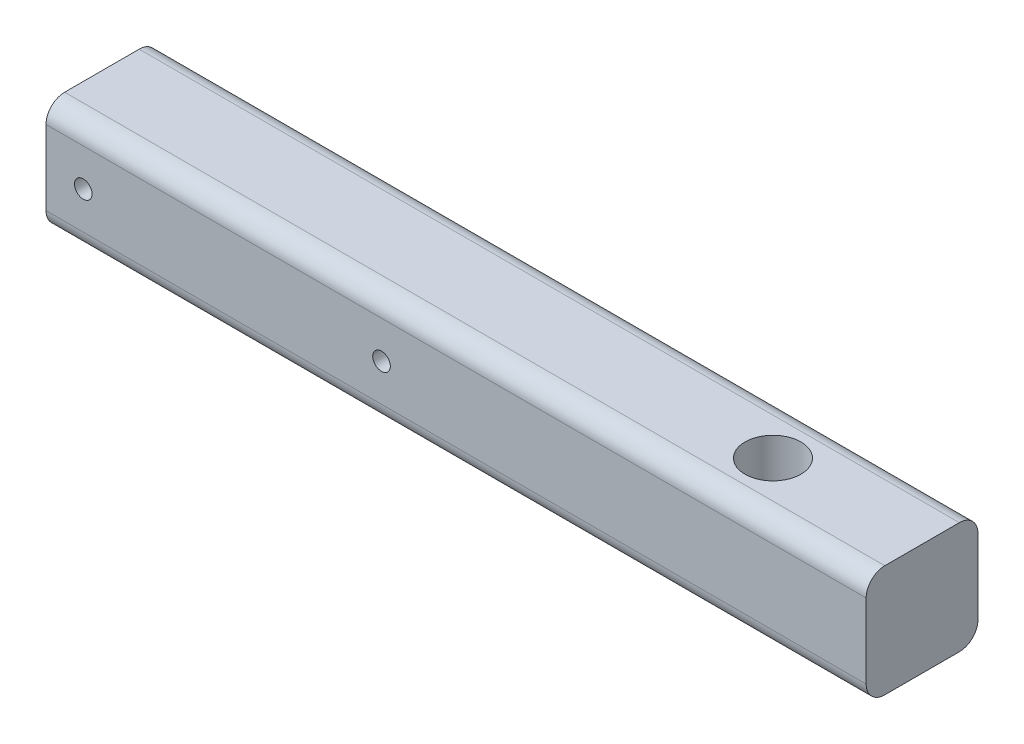
ISO-10303-21;
HEADER;
FILE_DESCRIPTION(('STEP AP214'),'2;1');
FILE_NAME('part.step','',(''),(''),'','','');
FILE_SCHEMA(('AUTOMOTIVE_DESIGN { 1 0 10303 214 1 1 1 1 }'));
ENDSEC;
DATA;
#1=APPLICATION_CONTEXT('core data for automotive mechanical design processes');
#2=APPLICATION_PROTOCOL_DEFINITION('international standard','automotive_design',2000,#1);
#3=PRODUCT_CONTEXT('',#1,'mechanical');
#4=PRODUCT('Part','Part','',(#3));
#5=PRODUCT_RELATED_PRODUCT_CATEGORY('part','',(#4));
#6=PRODUCT_DEFINITION_FORMATION('','',#4);
#7=PRODUCT_DEFINITION_CONTEXT('part definition',#1,'design');
#8=PRODUCT_DEFINITION('design','',#6,#7);
#9=PRODUCT_DEFINITION_SHAPE('','',#8);
#10=(LENGTH_UNIT() NAMED_UNIT(*) SI_UNIT(.MILLI.,.METRE.));
#11=(NAMED_UNIT(*) PLANE_ANGLE_UNIT() SI_UNIT($,.RADIAN.));
#12=(NAMED_UNIT(*) SI_UNIT($,.STERADIAN.) SOLID_ANGLE_UNIT());
#13=UNCERTAINTY_MEASURE_WITH_UNIT(LENGTH_MEASURE(1.E-05),#10,'distance_accuracy_value','');
#14=(GEOMETRIC_REPRESENTATION_CONTEXT(3) GLOBAL_UNCERTAINTY_ASSIGNED_CONTEXT((#13)) GLOBAL_UNIT_ASSIGNED_CONTEXT((#10,
#11,#12)) REPRESENTATION_CONTEXT('',''));
#15=CARTESIAN_POINT('',(0.,0.,0.));
#16=DIRECTION('',(0.,0.,1.));
#17=DIRECTION('',(1.,0.,0.));
#18=AXIS2_PLACEMENT_3D('',#15,#16,#17);
#19=CARTESIAN_POINT('',(139.7,-9.525,9.525));
#20=DIRECTION('',(0.,1.,0.));
#21=DIRECTION('',(0.,0.,1.));
#22=AXIS2_PLACEMENT_3D('',#19,#20,#21);
#23=PLANE('',#22);
#24=CARTESIAN_POINT('',(114.3,-9.525,0.));
#25=DIRECTION('',(0.,1.,0.));
#26=DIRECTION('',(0.,0.,1.));
#27=AXIS2_PLACEMENT_3D('',#24,#25,#26);
#28=CIRCLE('',#27,4.7625);
#29=CARTESIAN_POINT('',(114.3,-9.525,4.7625));
#30=VERTEX_POINT('',#29);
#31=EDGE_CURVE('E132',#30,#30,#28,.T.);
#32=ORIENTED_EDGE('',*,*,#31,.T.);
#33=EDGE_LOOP('',(#32));
#34=FACE_BOUND('',#33,.T.);
#35=DIRECTION('',(0.,0.,-1.));
#36=VECTOR('',#35,1.);
#37=CARTESIAN_POINT('',(0.,-9.525,9.525));
#38=LINE('',#37,#36);
#39=CARTESIAN_POINT('',(0.,-9.525,6.35));
#40=VERTEX_POINT('',#39);
#41=CARTESIAN_POINT('',(0.,-9.525,-6.34999999999999));
#42=VERTEX_POINT('',#41);
#43=EDGE_CURVE('E128',#40,#42,#38,.T.);
#44=ORIENTED_EDGE('',*,*,#43,.T.);
#45=DIRECTION('',(-1.,0.,0.));
#46=VECTOR('',#45,1.);
#47=CARTESIAN_POINT('',(139.7,-9.525,-6.35));
#48=LINE('',#47,#46);
#49=CARTESIAN_POINT('',(139.7,-9.525,-6.34999999999999));
#50=VERTEX_POINT('',#49);
#51=EDGE_CURVE('E105',#42,#50,#48,.F.);
#52=ORIENTED_EDGE('',*,*,#51,.T.);
#53=DIRECTION('',(0.,0.,-1.));
#54=VECTOR('',#53,1.);
#55=CARTESIAN_POINT('',(139.7,-9.525,9.525));
#56=LINE('',#55,#54);
#57=CARTESIAN_POINT('',(139.7,-9.525,6.35));
#58=VERTEX_POINT('',#57);
#59=EDGE_CURVE('E138',#58,#50,#56,.T.);
#60=ORIENTED_EDGE('',*,*,#59,.F.);
#61=DIRECTION('',(-1.,0.,0.));
#62=VECTOR('',#61,1.);
#63=CARTESIAN_POINT('',(0.,-9.525,6.35));
#64=LINE('',#63,#62);
#65=EDGE_CURVE('E110',#58,#40,#64,.T.);
#66=ORIENTED_EDGE('',*,*,#65,.T.);
#67=EDGE_LOOP('',(#44,#52,#60,#66));
#68=FACE_BOUND('',#67,.T.);
#69=ADVANCED_FACE('F33',(#34,#68),#23,.F.);
#70=CARTESIAN_POINT('',(139.7,-9.525,-9.525));
#71=DIRECTION('',(0.,0.,1.));
#72=DIRECTION('',(1.,0.,0.));
#73=AXIS2_PLACEMENT_3D('',#70,#71,#72);
#74=PLANE('',#73);
#75=CARTESIAN_POINT('',(57.15,0.,-9.525));
#76=DIRECTION('',(0.,0.,1.));
#77=DIRECTION('',(1.,0.,0.));
#78=AXIS2_PLACEMENT_3D('',#75,#76,#77);
#79=CIRCLE('',#78,1.5);
#80=CARTESIAN_POINT('',(58.65,0.,-9.525));
#81=VERTEX_POINT('',#80);
#82=EDGE_CURVE('E189',#81,#81,#79,.T.);
#83=ORIENTED_EDGE('',*,*,#82,.T.);
#84=EDGE_LOOP('',(#83));
#85=FACE_BOUND('',#84,.T.);
#86=CARTESIAN_POINT('',(6.35,0.,-9.525));
#87=DIRECTION('',(0.,0.,1.));
#88=DIRECTION('',(1.,0.,0.));
#89=AXIS2_PLACEMENT_3D('',#86,#87,#88);
#90=CIRCLE('',#89,1.5);
#91=CARTESIAN_POINT('',(7.85,0.,-9.525));
#92=VERTEX_POINT('',#91);
#93=EDGE_CURVE('E183',#92,#92,#90,.T.);
#94=ORIENTED_EDGE('',*,*,#93,.T.);
#95=EDGE_LOOP('',(#94));
#96=FACE_BOUND('',#95,.T.);
#97=DIRECTION('',(0.,1.,0.));
#98=VECTOR('',#97,1.);
#99=CARTESIAN_POINT('',(139.7,-9.525,-9.525));
#100=LINE('',#99,#98);
#101=CARTESIAN_POINT('',(139.7,-6.35,-9.525));
#102=VERTEX_POINT('',#101);
#103=CARTESIAN_POINT('',(139.7,6.34999999999999,-9.525));
#104=VERTEX_POINT('',#103);
#105=EDGE_CURVE('E120',#102,#104,#100,.T.);
#106=ORIENTED_EDGE('',*,*,#105,.F.);
#107=DIRECTION('',(-1.,0.,0.));
#108=VECTOR('',#107,1.);
#109=CARTESIAN_POINT('',(139.7,-6.35,-9.525));
#110=LINE('',#109,#108);
#111=CARTESIAN_POINT('',(0.,-6.35,-9.525));
#112=VERTEX_POINT('',#111);
#113=EDGE_CURVE('E104',#102,#112,#110,.T.);
#114=ORIENTED_EDGE('',*,*,#113,.T.);
#115=DIRECTION('',(0.,1.,0.));
#116=VECTOR('',#115,1.);
#117=CARTESIAN_POINT('',(0.,-9.525,-9.525));
#118=LINE('',#117,#116);
#119=CARTESIAN_POINT('',(0.,6.34999999999999,-9.525));
#120=VERTEX_POINT('',#119);
#121=EDGE_CURVE('E117',#112,#120,#118,.T.);
#122=ORIENTED_EDGE('',*,*,#121,.T.);
#123=DIRECTION('',(-1.,0.,0.));
#124=VECTOR('',#123,1.);
#125=CARTESIAN_POINT('',(139.7,6.35,-9.525));
#126=LINE('',#125,#124);
#127=EDGE_CURVE('E122',#120,#104,#126,.F.);
#128=ORIENTED_EDGE('',*,*,#127,.T.);
#129=EDGE_LOOP('',(#106,#114,#122,#128));
#130=FACE_BOUND('',#129,.T.);
#131=ADVANCED_FACE('F116',(#85,#96,#130),#74,.F.);
#132=CARTESIAN_POINT('',(139.7,9.525,9.525));
#133=DIRECTION('',(0.,1.,0.));
#134=DIRECTION('',(0.,0.,1.));
#135=AXIS2_PLACEMENT_3D('',#132,#133,#134);
#136=PLANE('',#135);
#137=CARTESIAN_POINT('',(114.3,9.525,0.));
#138=DIRECTION('',(0.,1.,0.));
#139=DIRECTION('',(0.,0.,1.));
#140=AXIS2_PLACEMENT_3D('',#137,#138,#139);
#141=CIRCLE('',#140,4.7625);
#142=CARTESIAN_POINT('',(114.3,9.525,4.7625));
#143=VERTEX_POINT('',#142);
#144=EDGE_CURVE('E180',#143,#143,#141,.T.);
#145=ORIENTED_EDGE('',*,*,#144,.F.);
#146=EDGE_LOOP('',(#145));
#147=FACE_BOUND('',#146,.T.);
#148=DIRECTION('',(0.,0.,-1.));
#149=VECTOR('',#148,1.);
#150=CARTESIAN_POINT('',(139.7,9.525,9.525));
#151=LINE('',#150,#149);
#152=CARTESIAN_POINT('',(139.7,9.525,6.35));
#153=VERTEX_POINT('',#152);
#154=CARTESIAN_POINT('',(139.7,9.525,-6.34999999999999));
#155=VERTEX_POINT('',#154);
#156=EDGE_CURVE('E162',#153,#155,#151,.T.);
#157=ORIENTED_EDGE('',*,*,#156,.T.);
#158=DIRECTION('',(-1.,0.,0.));
#159=VECTOR('',#158,1.);
#160=CARTESIAN_POINT('',(0.,9.525,-6.35));
#161=LINE('',#160,#159);
#162=CARTESIAN_POINT('',(0.,9.525,-6.34999999999999));
#163=VERTEX_POINT('',#162);
#164=EDGE_CURVE('E11',#155,#163,#161,.T.);
#165=ORIENTED_EDGE('',*,*,#164,.T.);
#166=DIRECTION('',(0.,0.,-1.));
#167=VECTOR('',#166,1.);
#168=CARTESIAN_POINT('',(0.,9.525,9.525));
#169=LINE('',#168,#167);
#170=CARTESIAN_POINT('',(0.,9.525,6.35));
#171=VERTEX_POINT('',#170);
#172=EDGE_CURVE('E127',#171,#163,#169,.T.);
#173=ORIENTED_EDGE('',*,*,#172,.F.);
#174=DIRECTION('',(-1.,0.,0.));
#175=VECTOR('',#174,1.);
#176=CARTESIAN_POINT('',(139.7,9.525,6.35));
#177=LINE('',#176,#175);
#178=EDGE_CURVE('E41',#171,#153,#177,.F.);
#179=ORIENTED_EDGE('',*,*,#178,.T.);
#180=EDGE_LOOP('',(#157,#165,#173,#179));
#181=FACE_BOUND('',#180,.T.);
#182=ADVANCED_FACE('F161',(#147,#181),#136,.T.);
#183=CARTESIAN_POINT('',(139.7,-9.525,9.525));
#184=DIRECTION('',(0.,0.,1.));
#185=DIRECTION('',(1.,0.,0.));
#186=AXIS2_PLACEMENT_3D('',#183,#184,#185);
#187=PLANE('',#186);
#188=CARTESIAN_POINT('',(57.15,0.,9.525));
#189=DIRECTION('',(0.,0.,1.));
#190=DIRECTION('',(1.,0.,0.));
#191=AXIS2_PLACEMENT_3D('',#188,#189,#190);
#192=CIRCLE('',#191,1.5);
#193=CARTESIAN_POINT('',(58.65,0.,9.525));
#194=VERTEX_POINT('',#193);
#195=EDGE_CURVE('E192',#194,#194,#192,.T.);
#196=ORIENTED_EDGE('',*,*,#195,.F.);
#197=EDGE_LOOP('',(#196));
#198=FACE_BOUND('',#197,.T.);
#199=CARTESIAN_POINT('',(6.35,0.,9.525));
#200=DIRECTION('',(0.,0.,1.));
#201=DIRECTION('',(1.,0.,0.));
#202=AXIS2_PLACEMENT_3D('',#199,#200,#201);
#203=CIRCLE('',#202,1.5);
#204=CARTESIAN_POINT('',(7.85,0.,9.525));
#205=VERTEX_POINT('',#204);
#206=EDGE_CURVE('E186',#205,#205,#203,.T.);
#207=ORIENTED_EDGE('',*,*,#206,.F.);
#208=EDGE_LOOP('',(#207));
#209=FACE_BOUND('',#208,.T.);
#210=DIRECTION('',(0.,1.,0.));
#211=VECTOR('',#210,1.);
#212=CARTESIAN_POINT('',(0.,-9.525,9.525));
#213=LINE('',#212,#211);
#214=CARTESIAN_POINT('',(0.,-6.35,9.525));
#215=VERTEX_POINT('',#214);
#216=CARTESIAN_POINT('',(0.,6.34999999999999,9.525));
#217=VERTEX_POINT('',#216);
#218=EDGE_CURVE('E130',#215,#217,#213,.T.);
#219=ORIENTED_EDGE('',*,*,#218,.F.);
#220=DIRECTION('',(-1.,0.,0.));
#221=VECTOR('',#220,1.);
#222=CARTESIAN_POINT('',(139.7,-6.35,9.525));
#223=LINE('',#222,#221);
#224=CARTESIAN_POINT('',(139.7,-6.35,9.525));
#225=VERTEX_POINT('',#224);
#226=EDGE_CURVE('E55',#215,#225,#223,.F.);
#227=ORIENTED_EDGE('',*,*,#226,.T.);
#228=DIRECTION('',(0.,1.,0.));
#229=VECTOR('',#228,1.);
#230=CARTESIAN_POINT('',(139.7,-9.525,9.525));
#231=LINE('',#230,#229);
#232=CARTESIAN_POINT('',(139.7,6.34999999999999,9.525));
#233=VERTEX_POINT('',#232);
#234=EDGE_CURVE('E139',#225,#233,#231,.T.);
#235=ORIENTED_EDGE('',*,*,#234,.T.);
#236=DIRECTION('',(-1.,0.,0.));
#237=VECTOR('',#236,1.);
#238=CARTESIAN_POINT('',(139.7,6.35,9.525));
#239=LINE('',#238,#237);
#240=EDGE_CURVE('E154',#233,#217,#239,.T.);
#241=ORIENTED_EDGE('',*,*,#240,.T.);
#242=EDGE_LOOP('',(#219,#227,#235,#241));
#243=FACE_BOUND('',#242,.T.);
#244=ADVANCED_FACE('F170',(#198,#209,#243),#187,.T.);
#245=CARTESIAN_POINT('',(139.7,0.,0.));
#246=DIRECTION('',(1.,0.,0.));
#247=DIRECTION('',(0.,0.,-1.));
#248=AXIS2_PLACEMENT_3D('',#245,#246,#247);
#249=PLANE('',#248);
#250=ORIENTED_EDGE('',*,*,#59,.T.);
#251=CARTESIAN_POINT('',(139.7,-6.35,-6.35));
#252=DIRECTION('',(1.,0.,0.));
#253=DIRECTION('',(0.,0.,-1.));
#254=AXIS2_PLACEMENT_3D('',#251,#252,#253);
#255=CIRCLE('',#254,3.175);
#256=EDGE_CURVE('E152',#50,#102,#255,.T.);
#257=ORIENTED_EDGE('',*,*,#256,.T.);
#258=ORIENTED_EDGE('',*,*,#105,.T.);
#259=CARTESIAN_POINT('',(139.7,6.35,-6.35));
#260=DIRECTION('',(1.,0.,0.));
#261=DIRECTION('',(0.,0.,-1.));
#262=AXIS2_PLACEMENT_3D('',#259,#260,#261);
#263=CIRCLE('',#262,3.175);
#264=EDGE_CURVE('E148',#104,#155,#263,.T.);
#265=ORIENTED_EDGE('',*,*,#264,.T.);
#266=ORIENTED_EDGE('',*,*,#156,.F.);
#267=CARTESIAN_POINT('',(139.7,6.35,6.35));
#268=DIRECTION('',(1.,0.,0.));
#269=DIRECTION('',(0.,0.,-1.));
#270=AXIS2_PLACEMENT_3D('',#267,#268,#269);
#271=CIRCLE('',#270,3.175);
#272=EDGE_CURVE('E48',#153,#233,#271,.T.);
#273=ORIENTED_EDGE('',*,*,#272,.T.);
#274=ORIENTED_EDGE('',*,*,#234,.F.);
#275=CARTESIAN_POINT('',(139.7,-6.35,6.35));
#276=DIRECTION('',(1.,0.,0.));
#277=DIRECTION('',(0.,0.,-1.));
#278=AXIS2_PLACEMENT_3D('',#275,#276,#277);
#279=CIRCLE('',#278,3.175);
#280=EDGE_CURVE('E150',#225,#58,#279,.T.);
#281=ORIENTED_EDGE('',*,*,#280,.T.);
#282=EDGE_LOOP('',(#250,#257,#258,#265,#266,#273,#274,#281));
#283=FACE_BOUND('',#282,.T.);
#284=ADVANCED_FACE('F166',(#283),#249,.T.);
#285=CARTESIAN_POINT('',(0.,0.,0.));
#286=DIRECTION('',(1.,0.,0.));
#287=DIRECTION('',(0.,0.,-1.));
#288=AXIS2_PLACEMENT_3D('',#285,#286,#287);
#289=PLANE('',#288);
#290=ORIENTED_EDGE('',*,*,#121,.F.);
#291=CARTESIAN_POINT('',(0.,-6.35,-6.35));
#292=DIRECTION('',(1.,0.,0.));
#293=DIRECTION('',(0.,0.,-1.));
#294=AXIS2_PLACEMENT_3D('',#291,#292,#293);
#295=CIRCLE('',#294,3.175);
#296=EDGE_CURVE('E100',#112,#42,#295,.F.);
#297=ORIENTED_EDGE('',*,*,#296,.T.);
#298=ORIENTED_EDGE('',*,*,#43,.F.);
#299=CARTESIAN_POINT('',(0.,-6.35,6.35));
#300=DIRECTION('',(1.,0.,0.));
#301=DIRECTION('',(0.,0.,-1.));
#302=AXIS2_PLACEMENT_3D('',#299,#300,#301);
#303=CIRCLE('',#302,3.175);
#304=EDGE_CURVE('E111',#40,#215,#303,.F.);
#305=ORIENTED_EDGE('',*,*,#304,.T.);
#306=ORIENTED_EDGE('',*,*,#218,.T.);
#307=CARTESIAN_POINT('',(0.,6.35,6.35));
#308=DIRECTION('',(1.,0.,0.));
#309=DIRECTION('',(0.,0.,-1.));
#310=AXIS2_PLACEMENT_3D('',#307,#308,#309);
#311=CIRCLE('',#310,3.175);
#312=EDGE_CURVE('E121',#217,#171,#311,.F.);
#313=ORIENTED_EDGE('',*,*,#312,.T.);
#314=ORIENTED_EDGE('',*,*,#172,.T.);
#315=CARTESIAN_POINT('',(0.,6.35,-6.35));
#316=DIRECTION('',(1.,0.,0.));
#317=DIRECTION('',(0.,0.,-1.));
#318=AXIS2_PLACEMENT_3D('',#315,#316,#317);
#319=CIRCLE('',#318,3.175);
#320=EDGE_CURVE('E126',#163,#120,#319,.F.);
#321=ORIENTED_EDGE('',*,*,#320,.T.);
#322=EDGE_LOOP('',(#290,#297,#298,#305,#306,#313,#314,#321));
#323=FACE_BOUND('',#322,.T.);
#324=ADVANCED_FACE('F124',(#323),#289,.F.);
#325=CARTESIAN_POINT('',(114.3,-9.525,0.));
#326=DIRECTION('',(0.,1.,0.));
#327=DIRECTION('',(0.,0.,1.));
#328=AXIS2_PLACEMENT_3D('',#325,#326,#327);
#329=CYLINDRICAL_SURFACE('',#328,4.7625);
#330=ORIENTED_EDGE('',*,*,#31,.F.);
#331=EDGE_LOOP('',(#330));
#332=FACE_BOUND('',#331,.T.);
#333=ORIENTED_EDGE('',*,*,#144,.T.);
#334=EDGE_LOOP('',(#333));
#335=FACE_BOUND('',#334,.T.);
#336=ADVANCED_FACE('F213',(#332,#335),#329,.F.);
#337=CARTESIAN_POINT('',(6.35,0.,-9.525));
#338=DIRECTION('',(0.,0.,1.));
#339=DIRECTION('',(1.,0.,0.));
#340=AXIS2_PLACEMENT_3D('',#337,#338,#339);
#341=CYLINDRICAL_SURFACE('',#340,1.5);
#342=ORIENTED_EDGE('',*,*,#93,.F.);
#343=EDGE_LOOP('',(#342));
#344=FACE_BOUND('',#343,.T.);
#345=ORIENTED_EDGE('',*,*,#206,.T.);
#346=EDGE_LOOP('',(#345));
#347=FACE_BOUND('',#346,.T.);
#348=ADVANCED_FACE('F203',(#344,#347),#341,.F.);
#349=CARTESIAN_POINT('',(57.15,0.,-9.525));
#350=DIRECTION('',(0.,0.,1.));
#351=DIRECTION('',(1.,0.,0.));
#352=AXIS2_PLACEMENT_3D('',#349,#350,#351);
#353=CYLINDRICAL_SURFACE('',#352,1.5);
#354=ORIENTED_EDGE('',*,*,#82,.F.);
#355=EDGE_LOOP('',(#354));
#356=FACE_BOUND('',#355,.T.);
#357=ORIENTED_EDGE('',*,*,#195,.T.);
#358=EDGE_LOOP('',(#357));
#359=FACE_BOUND('',#358,.T.);
#360=ADVANCED_FACE('F200',(#356,#359),#353,.F.);
#361=CARTESIAN_POINT('',(139.7,-6.35,-6.35));
#362=DIRECTION('',(-1.,0.,0.));
#363=DIRECTION('',(0.,0.,1.));
#364=AXIS2_PLACEMENT_3D('',#361,#362,#363);
#365=CYLINDRICAL_SURFACE('',#364,3.175);
#366=ORIENTED_EDGE('',*,*,#256,.F.);
#367=ORIENTED_EDGE('',*,*,#51,.F.);
#368=ORIENTED_EDGE('',*,*,#296,.F.);
#369=ORIENTED_EDGE('',*,*,#113,.F.);
#370=EDGE_LOOP('',(#366,#367,#368,#369));
#371=FACE_BOUND('',#370,.T.);
#372=ADVANCED_FACE('F103',(#371),#365,.T.);
#373=CARTESIAN_POINT('',(139.7,-6.35,6.35));
#374=DIRECTION('',(1.,0.,0.));
#375=DIRECTION('',(0.,0.,-1.));
#376=AXIS2_PLACEMENT_3D('',#373,#374,#375);
#377=CYLINDRICAL_SURFACE('',#376,3.175);
#378=ORIENTED_EDGE('',*,*,#280,.F.);
#379=ORIENTED_EDGE('',*,*,#226,.F.);
#380=ORIENTED_EDGE('',*,*,#304,.F.);
#381=ORIENTED_EDGE('',*,*,#65,.F.);
#382=EDGE_LOOP('',(#378,#379,#380,#381));
#383=FACE_BOUND('',#382,.T.);
#384=ADVANCED_FACE('F174',(#383),#377,.T.);
#385=CARTESIAN_POINT('',(139.7,6.35,-6.35));
#386=DIRECTION('',(1.,0.,0.));
#387=DIRECTION('',(0.,0.,-1.));
#388=AXIS2_PLACEMENT_3D('',#385,#386,#387);
#389=CYLINDRICAL_SURFACE('',#388,3.175);
#390=ORIENTED_EDGE('',*,*,#264,.F.);
#391=ORIENTED_EDGE('',*,*,#127,.F.);
#392=ORIENTED_EDGE('',*,*,#320,.F.);
#393=ORIENTED_EDGE('',*,*,#164,.F.);
#394=EDGE_LOOP('',(#390,#391,#392,#393));
#395=FACE_BOUND('',#394,.T.);
#396=ADVANCED_FACE('F234',(#395),#389,.T.);
#397=CARTESIAN_POINT('',(139.7,6.35,6.35));
#398=DIRECTION('',(-1.,0.,0.));
#399=DIRECTION('',(0.,0.,1.));
#400=AXIS2_PLACEMENT_3D('',#397,#398,#399);
#401=CYLINDRICAL_SURFACE('',#400,3.175);
#402=ORIENTED_EDGE('',*,*,#272,.F.);
#403=ORIENTED_EDGE('',*,*,#178,.F.);
#404=ORIENTED_EDGE('',*,*,#312,.F.);
#405=ORIENTED_EDGE('',*,*,#240,.F.);
#406=EDGE_LOOP('',(#402,#403,#404,#405));
#407=FACE_BOUND('',#406,.T.);
#408=ADVANCED_FACE('F35',(#407),#401,.T.);
#409=CLOSED_SHELL('',(#69,#131,#182,#244,#284,#324,#336,#348,#360,#372,#384,#396,#408));
#410=MANIFOLD_SOLID_BREP('B2',#409);
#411=ADVANCED_BREP_SHAPE_REPRESENTATION('',(#18,#410),#14);
#412=SHAPE_DEFINITION_REPRESENTATION(#9,#411);
ENDSEC;
END-ISO-10303-21;
